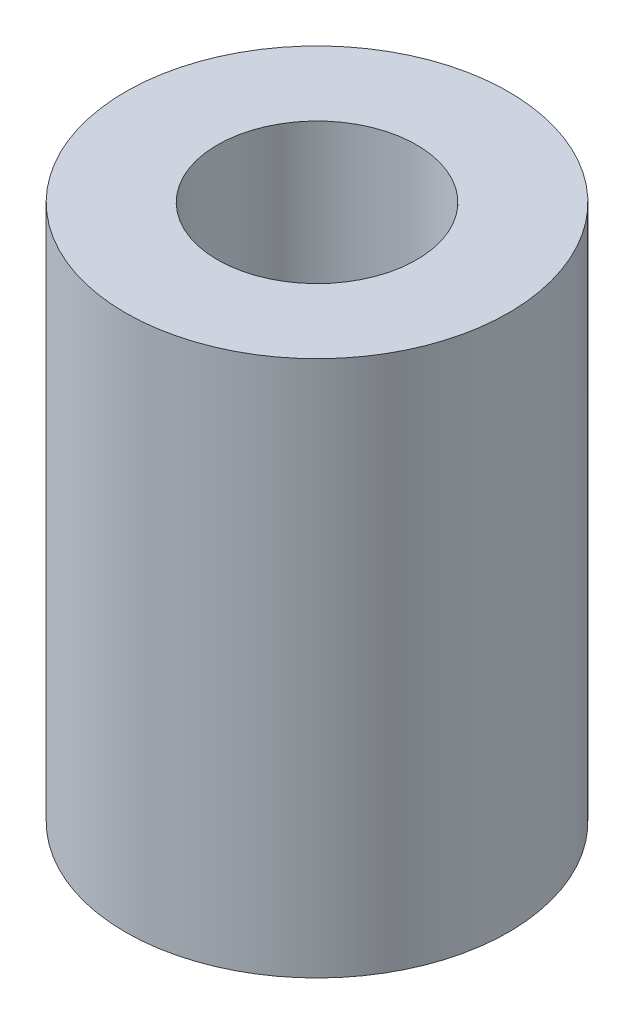
ISO-10303-21;
HEADER;
FILE_DESCRIPTION(('STEP AP214'),'2;1');
FILE_NAME('part.step','',(''),(''),'','','');
FILE_SCHEMA(('AUTOMOTIVE_DESIGN { 1 0 10303 214 1 1 1 1 }'));
ENDSEC;
DATA;
#1=APPLICATION_CONTEXT('core data for automotive mechanical design processes');
#2=APPLICATION_PROTOCOL_DEFINITION('international standard','automotive_design',2000,#1);
#3=PRODUCT_CONTEXT('',#1,'mechanical');
#4=PRODUCT('Part','Part','',(#3));
#5=PRODUCT_RELATED_PRODUCT_CATEGORY('part','',(#4));
#6=PRODUCT_DEFINITION_FORMATION('','',#4);
#7=PRODUCT_DEFINITION_CONTEXT('part definition',#1,'design');
#8=PRODUCT_DEFINITION('design','',#6,#7);
#9=PRODUCT_DEFINITION_SHAPE('','',#8);
#10=(LENGTH_UNIT() NAMED_UNIT(*) SI_UNIT(.MILLI.,.METRE.));
#11=(NAMED_UNIT(*) PLANE_ANGLE_UNIT() SI_UNIT($,.RADIAN.));
#12=(NAMED_UNIT(*) SI_UNIT($,.STERADIAN.) SOLID_ANGLE_UNIT());
#13=UNCERTAINTY_MEASURE_WITH_UNIT(LENGTH_MEASURE(1.E-05),#10,'distance_accuracy_value','');
#14=(GEOMETRIC_REPRESENTATION_CONTEXT(3) GLOBAL_UNCERTAINTY_ASSIGNED_CONTEXT((#13)) GLOBAL_UNIT_ASSIGNED_CONTEXT((#10,
#11,#12)) REPRESENTATION_CONTEXT('',''));
#15=CARTESIAN_POINT('',(0.,0.,0.));
#16=DIRECTION('',(0.,0.,1.));
#17=DIRECTION('',(1.,0.,0.));
#18=AXIS2_PLACEMENT_3D('',#15,#16,#17);
#19=CARTESIAN_POINT('',(0.,14.,0.));
#20=DIRECTION('',(0.,1.,0.));
#21=DIRECTION('',(0.,0.,1.));
#22=AXIS2_PLACEMENT_3D('',#19,#20,#21);
#23=PLANE('',#22);
#24=CARTESIAN_POINT('',(0.,14.,0.));
#25=DIRECTION('',(0.,1.,0.));
#26=DIRECTION('',(0.,0.,1.));
#27=AXIS2_PLACEMENT_3D('',#24,#25,#26);
#28=CIRCLE('',#27,5.);
#29=CARTESIAN_POINT('',(0.,14.,5.));
#30=VERTEX_POINT('',#29);
#31=EDGE_CURVE('E10',#30,#30,#28,.T.);
#32=ORIENTED_EDGE('',*,*,#31,.T.);
#33=EDGE_LOOP('',(#32));
#34=FACE_BOUND('',#33,.T.);
#35=CARTESIAN_POINT('',(0.,14.,0.));
#36=DIRECTION('',(0.,1.,0.));
#37=DIRECTION('',(0.,0.,1.));
#38=AXIS2_PLACEMENT_3D('',#35,#36,#37);
#39=CIRCLE('',#38,2.6);
#40=CARTESIAN_POINT('',(0.,14.,2.6));
#41=VERTEX_POINT('',#40);
#42=EDGE_CURVE('E52',#41,#41,#39,.T.);
#43=ORIENTED_EDGE('',*,*,#42,.F.);
#44=EDGE_LOOP('',(#43));
#45=FACE_BOUND('',#44,.T.);
#46=ADVANCED_FACE('F39',(#34,#45),#23,.T.);
#47=CARTESIAN_POINT('',(0.,0.,0.));
#48=DIRECTION('',(0.,1.,0.));
#49=DIRECTION('',(0.,0.,1.));
#50=AXIS2_PLACEMENT_3D('',#47,#48,#49);
#51=PLANE('',#50);
#52=CARTESIAN_POINT('',(0.,0.,0.));
#53=DIRECTION('',(0.,1.,0.));
#54=DIRECTION('',(0.,0.,1.));
#55=AXIS2_PLACEMENT_3D('',#52,#53,#54);
#56=CIRCLE('',#55,5.);
#57=CARTESIAN_POINT('',(0.,0.,5.));
#58=VERTEX_POINT('',#57);
#59=EDGE_CURVE('E43',#58,#58,#56,.T.);
#60=ORIENTED_EDGE('',*,*,#59,.F.);
#61=EDGE_LOOP('',(#60));
#62=FACE_BOUND('',#61,.T.);
#63=CARTESIAN_POINT('',(0.,0.,0.));
#64=DIRECTION('',(0.,1.,0.));
#65=DIRECTION('',(0.,0.,1.));
#66=AXIS2_PLACEMENT_3D('',#63,#64,#65);
#67=CIRCLE('',#66,2.6);
#68=CARTESIAN_POINT('',(0.,0.,2.6));
#69=VERTEX_POINT('',#68);
#70=EDGE_CURVE('E54',#69,#69,#67,.T.);
#71=ORIENTED_EDGE('',*,*,#70,.T.);
#72=EDGE_LOOP('',(#71));
#73=FACE_BOUND('',#72,.T.);
#74=ADVANCED_FACE('F66',(#62,#73),#51,.F.);
#75=CARTESIAN_POINT('',(0.,14.,0.));
#76=DIRECTION('',(0.,-1.,0.));
#77=DIRECTION('',(0.,0.,-1.));
#78=AXIS2_PLACEMENT_3D('',#75,#76,#77);
#79=CYLINDRICAL_SURFACE('',#78,5.);
#80=ORIENTED_EDGE('',*,*,#31,.F.);
#81=EDGE_LOOP('',(#80));
#82=FACE_BOUND('',#81,.T.);
#83=ORIENTED_EDGE('',*,*,#59,.T.);
#84=EDGE_LOOP('',(#83));
#85=FACE_BOUND('',#84,.T.);
#86=ADVANCED_FACE('F41',(#82,#85),#79,.T.);
#87=CARTESIAN_POINT('',(0.,14.,0.));
#88=DIRECTION('',(0.,-1.,0.));
#89=DIRECTION('',(0.,0.,-1.));
#90=AXIS2_PLACEMENT_3D('',#87,#88,#89);
#91=CYLINDRICAL_SURFACE('',#90,2.6);
#92=ORIENTED_EDGE('',*,*,#42,.T.);
#93=EDGE_LOOP('',(#92));
#94=FACE_BOUND('',#93,.T.);
#95=ORIENTED_EDGE('',*,*,#70,.F.);
#96=EDGE_LOOP('',(#95));
#97=FACE_BOUND('',#96,.T.);
#98=ADVANCED_FACE('F62',(#94,#97),#91,.F.);
#99=CLOSED_SHELL('',(#46,#74,#86,#98));
#100=MANIFOLD_SOLID_BREP('B2',#99);
#101=ADVANCED_BREP_SHAPE_REPRESENTATION('',(#18,#100),#14);
#102=SHAPE_DEFINITION_REPRESENTATION(#9,#101);
ENDSEC;
END-ISO-10303-21;
